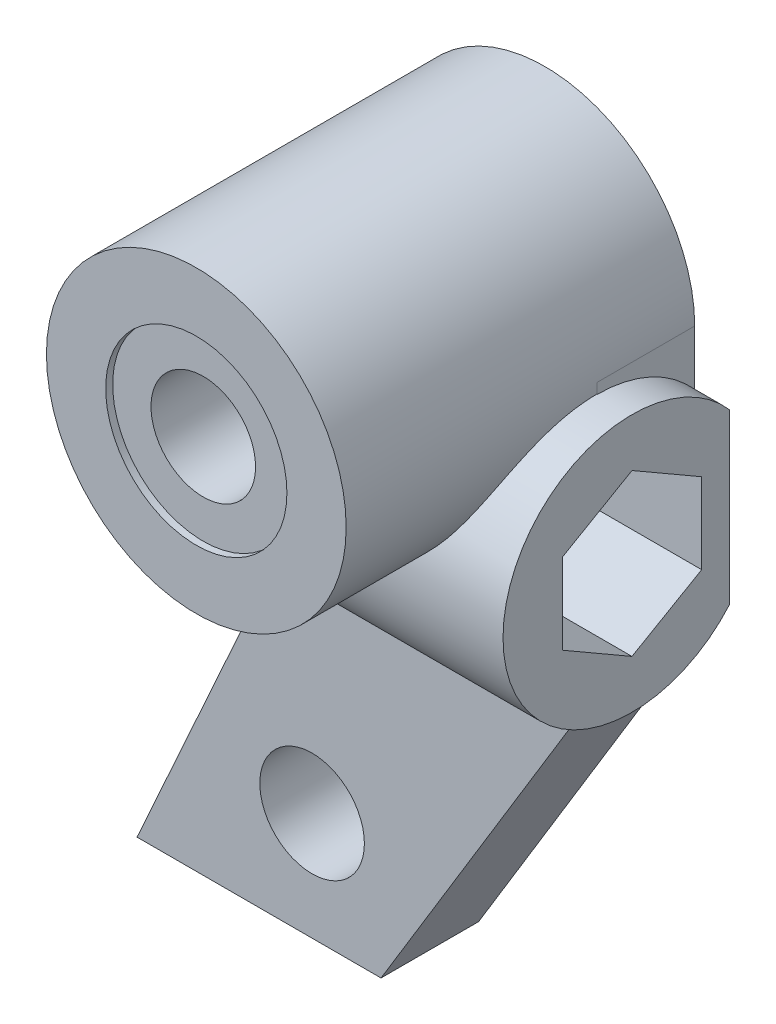
ISO-10303-21;
HEADER;
FILE_DESCRIPTION(('STEP AP214'),'2;1');
FILE_NAME('part.step','',(''),(''),'','','');
FILE_SCHEMA(('AUTOMOTIVE_DESIGN { 1 0 10303 214 1 1 1 1 }'));
ENDSEC;
DATA;
#1=APPLICATION_CONTEXT('core data for automotive mechanical design processes');
#2=APPLICATION_PROTOCOL_DEFINITION('international standard','automotive_design',2000,#1);
#3=PRODUCT_CONTEXT('',#1,'mechanical');
#4=PRODUCT('Part','Part','',(#3));
#5=PRODUCT_RELATED_PRODUCT_CATEGORY('part','',(#4));
#6=PRODUCT_DEFINITION_FORMATION('','',#4);
#7=PRODUCT_DEFINITION_CONTEXT('part definition',#1,'design');
#8=PRODUCT_DEFINITION('design','',#6,#7);
#9=PRODUCT_DEFINITION_SHAPE('','',#8);
#10=(LENGTH_UNIT() NAMED_UNIT(*) SI_UNIT(.MILLI.,.METRE.));
#11=(NAMED_UNIT(*) PLANE_ANGLE_UNIT() SI_UNIT($,.RADIAN.));
#12=(NAMED_UNIT(*) SI_UNIT($,.STERADIAN.) SOLID_ANGLE_UNIT());
#13=UNCERTAINTY_MEASURE_WITH_UNIT(LENGTH_MEASURE(1.E-05),#10,'distance_accuracy_value','');
#14=(GEOMETRIC_REPRESENTATION_CONTEXT(3) GLOBAL_UNCERTAINTY_ASSIGNED_CONTEXT((#13)) GLOBAL_UNIT_ASSIGNED_CONTEXT((#10,
#11,#12)) REPRESENTATION_CONTEXT('',''));
#15=CARTESIAN_POINT('',(0.,0.,0.));
#16=DIRECTION('',(0.,0.,1.));
#17=DIRECTION('',(1.,0.,0.));
#18=AXIS2_PLACEMENT_3D('',#15,#16,#17);
#19=CARTESIAN_POINT('',(4.3,0.,2.8));
#20=DIRECTION('',(-1.,0.,0.));
#21=DIRECTION('',(0.,0.,1.));
#22=AXIS2_PLACEMENT_3D('',#19,#20,#21);
#23=PLANE('',#22);
#24=DIRECTION('',(0.,1.,0.));
#25=VECTOR('',#24,1.);
#26=CARTESIAN_POINT('',(4.3,0.,2.8));
#27=LINE('',#26,#25);
#28=CARTESIAN_POINT('',(4.3,-0.3,2.8));
#29=VERTEX_POINT('',#28);
#30=CARTESIAN_POINT('',(4.3,0.,2.8));
#31=VERTEX_POINT('',#30);
#32=EDGE_CURVE('E307',#29,#31,#27,.T.);
#33=ORIENTED_EDGE('',*,*,#32,.F.);
#34=CARTESIAN_POINT('',(4.3,-4.,2.8));
#35=DIRECTION('',(-1.,0.,0.));
#36=DIRECTION('',(0.,0.,1.));
#37=AXIS2_PLACEMENT_3D('',#34,#35,#36);
#38=CIRCLE('',#37,3.7);
#39=CARTESIAN_POINT('',(4.3,-1.58132267551043,0.));
#40=VERTEX_POINT('',#39);
#41=EDGE_CURVE('E229',#29,#40,#38,.T.);
#42=ORIENTED_EDGE('',*,*,#41,.T.);
#43=DIRECTION('',(0.,1.,0.));
#44=VECTOR('',#43,1.);
#45=CARTESIAN_POINT('',(4.3,0.,0.));
#46=LINE('',#45,#44);
#47=CARTESIAN_POINT('',(4.3,0.,0.));
#48=VERTEX_POINT('',#47);
#49=EDGE_CURVE('E364',#40,#48,#46,.T.);
#50=ORIENTED_EDGE('',*,*,#49,.T.);
#51=DIRECTION('',(0.,0.,-1.));
#52=VECTOR('',#51,1.);
#53=CARTESIAN_POINT('',(4.3,0.,2.8));
#54=LINE('',#53,#52);
#55=EDGE_CURVE('E311',#31,#48,#54,.T.);
#56=ORIENTED_EDGE('',*,*,#55,.F.);
#57=EDGE_LOOP('',(#33,#42,#50,#56));
#58=FACE_BOUND('',#57,.T.);
#59=ADVANCED_FACE('F37',(#58),#23,.F.);
#60=CARTESIAN_POINT('',(0.,0.,2.8));
#61=DIRECTION('',(0.,0.,1.));
#62=DIRECTION('',(1.,0.,0.));
#63=AXIS2_PLACEMENT_3D('',#60,#61,#62);
#64=PLANE('',#63);
#65=DIRECTION('',(-1.,0.,0.));
#66=VECTOR('',#65,1.);
#67=CARTESIAN_POINT('',(5.3,-0.3,2.8));
#68=LINE('',#67,#66);
#69=CARTESIAN_POINT('',(4.28952211790544,-0.3,2.8));
#70=VERTEX_POINT('',#69);
#71=EDGE_CURVE('E61',#29,#70,#68,.T.);
#72=ORIENTED_EDGE('',*,*,#71,.F.);
#73=ORIENTED_EDGE('',*,*,#32,.T.);
#74=CARTESIAN_POINT('',(0.,0.,2.8));
#75=DIRECTION('',(0.,0.,1.));
#76=DIRECTION('',(1.,0.,0.));
#77=AXIS2_PLACEMENT_3D('',#74,#75,#76);
#78=CIRCLE('',#77,4.3);
#79=EDGE_CURVE('E331',#70,#31,#78,.T.);
#80=ORIENTED_EDGE('',*,*,#79,.F.);
#81=EDGE_LOOP('',(#72,#73,#80));
#82=FACE_BOUND('',#81,.T.);
#83=ADVANCED_FACE('F269',(#82),#64,.T.);
#84=CARTESIAN_POINT('',(-4.28952211790544,-0.3,2.8));
#85=VERTEX_POINT('',#84);
#86=CARTESIAN_POINT('',(-4.3,-0.3,2.8));
#87=VERTEX_POINT('',#86);
#88=EDGE_CURVE('E228',#85,#87,#68,.T.);
#89=ORIENTED_EDGE('',*,*,#88,.F.);
#90=CARTESIAN_POINT('',(-4.3,0.,2.8));
#91=VERTEX_POINT('',#90);
#92=EDGE_CURVE('E332',#91,#85,#78,.T.);
#93=ORIENTED_EDGE('',*,*,#92,.F.);
#94=DIRECTION('',(0.,-1.,0.));
#95=VECTOR('',#94,1.);
#96=CARTESIAN_POINT('',(-4.3,0.,2.8));
#97=LINE('',#96,#95);
#98=EDGE_CURVE('E336',#91,#87,#97,.T.);
#99=ORIENTED_EDGE('',*,*,#98,.T.);
#100=EDGE_LOOP('',(#89,#93,#99));
#101=FACE_BOUND('',#100,.T.);
#102=ADVANCED_FACE('F270',(#101),#64,.T.);
#103=CARTESIAN_POINT('',(0.,0.,2.8));
#104=DIRECTION('',(0.,0.,-1.));
#105=DIRECTION('',(-1.,0.,0.));
#106=AXIS2_PLACEMENT_3D('',#103,#104,#105);
#107=CYLINDRICAL_SURFACE('',#106,1.5);
#108=CARTESIAN_POINT('',(0.,0.,0.));
#109=DIRECTION('',(0.,0.,1.));
#110=DIRECTION('',(1.,0.,0.));
#111=AXIS2_PLACEMENT_3D('',#108,#109,#110);
#112=CIRCLE('',#111,1.5);
#113=CARTESIAN_POINT('',(1.5,0.,0.));
#114=VERTEX_POINT('',#113);
#115=EDGE_CURVE('E335',#114,#114,#112,.T.);
#116=ORIENTED_EDGE('',*,*,#115,.F.);
#117=EDGE_LOOP('',(#116));
#118=FACE_BOUND('',#117,.T.);
#119=CARTESIAN_POINT('',(0.,0.,9.8));
#120=DIRECTION('',(0.,0.,1.));
#121=DIRECTION('',(1.,0.,0.));
#122=AXIS2_PLACEMENT_3D('',#119,#120,#121);
#123=CIRCLE('',#122,1.5);
#124=CARTESIAN_POINT('',(1.5,0.,9.8));
#125=VERTEX_POINT('',#124);
#126=EDGE_CURVE('E238',#125,#125,#123,.T.);
#127=ORIENTED_EDGE('',*,*,#126,.T.);
#128=EDGE_LOOP('',(#127));
#129=FACE_BOUND('',#128,.T.);
#130=ADVANCED_FACE('F39',(#118,#129),#107,.F.);
#131=CARTESIAN_POINT('',(0.,0.,2.8));
#132=DIRECTION('',(0.,0.,-1.));
#133=DIRECTION('',(-1.,0.,0.));
#134=AXIS2_PLACEMENT_3D('',#131,#132,#133);
#135=CYLINDRICAL_SURFACE('',#134,4.3);
#136=ORIENTED_EDGE('',*,*,#92,.T.);
#137=CARTESIAN_POINT('',(-3.99867710573341,-1.58132267551043,0.));
#138=CARTESIAN_POINT('',(-4.02620486842408,-1.51172721531437,0.0600797642274034));
#139=CARTESIAN_POINT('',(-4.05096031246293,-1.44380215384755,0.123319114317478));
#140=CARTESIAN_POINT('',(-4.09549198022645,-1.31215776301694,0.25556570846073));
#141=CARTESIAN_POINT('',(-4.11527181700473,-1.24843540679834,0.324568718428721));
#142=CARTESIAN_POINT('',(-4.15038084887827,-1.12621952073223,0.46757387596933));
#143=CARTESIAN_POINT('',(-4.16572871648545,-1.06770479400466,0.541553381354812));
#144=CARTESIAN_POINT('',(-4.19272511903358,-0.956214545027081,0.694221609223177));
#145=CARTESIAN_POINT('',(-4.20437311186129,-0.903239835273751,0.772911019805469));
#146=CARTESIAN_POINT('',(-4.2245755965669,-0.803459809449619,0.934227477942213));
#147=CARTESIAN_POINT('',(-4.2331371179305,-0.756640630694397,1.01684508653121));
#148=CARTESIAN_POINT('',(-4.24780593926862,-0.669404551806675,1.18563845888953));
#149=CARTESIAN_POINT('',(-4.25391230559438,-0.628990090799319,1.27181556255559));
#150=CARTESIAN_POINT('',(-4.26421447689929,-0.554866369647669,1.44717988130181));
#151=CARTESIAN_POINT('',(-4.26840905110517,-0.521161436803233,1.53636899588751));
#152=CARTESIAN_POINT('',(-4.27535499572856,-0.460722422667956,1.71713450120877));
#153=CARTESIAN_POINT('',(-4.27810630150983,-0.433988653605107,1.80871099866965));
#154=CARTESIAN_POINT('',(-4.28267595360315,-0.386382623768759,1.99881603842775));
#155=CARTESIAN_POINT('',(-4.28443404126961,-0.365918056802774,2.09744832854939));
#156=CARTESIAN_POINT('',(-4.28711010408826,-0.333103376836591,2.29602277641901));
#157=CARTESIAN_POINT('',(-4.28802840939627,-0.320750075475985,2.39596440372008));
#158=CARTESIAN_POINT('',(-4.28923256896984,-0.304225226347709,2.59657308447109));
#159=CARTESIAN_POINT('',(-4.28951812672748,-0.300057514482398,2.6972404558498));
#160=CARTESIAN_POINT('',(-4.28952602519558,-0.299943685629092,2.89854498062574));
#161=CARTESIAN_POINT('',(-4.28924855595478,-0.30399479439307,2.99918213275521));
#162=CARTESIAN_POINT('',(-4.28804545082708,-0.320527119262826,3.2027579131261));
#163=CARTESIAN_POINT('',(-4.28710088472375,-0.333254156250416,3.30567656259077));
#164=CARTESIAN_POINT('',(-4.28431835395937,-0.367297222939065,3.510074165217));
#165=CARTESIAN_POINT('',(-4.28248036385706,-0.388613497225399,3.61155307729572));
#166=CARTESIAN_POINT('',(-4.2775391865435,-0.439677107571947,3.81233955961817));
#167=CARTESIAN_POINT('',(-4.27443597455657,-0.469424608729523,3.91164708730159));
#168=CARTESIAN_POINT('',(-4.26645610145018,-0.537135148987374,4.10740098565133));
#169=CARTESIAN_POINT('',(-4.2615786396868,-0.575101893948305,4.20384604332088));
#170=CARTESIAN_POINT('',(-4.24945645675381,-0.658705890366704,4.39259237670862));
#171=CARTESIAN_POINT('',(-4.24222434545982,-0.704301667287678,4.48491281025054));
#172=CARTESIAN_POINT('',(-4.22467912119803,-0.802863117938565,4.66517041104212));
#173=CARTESIAN_POINT('',(-4.21436761144423,-0.855824949064252,4.75310983142962));
#174=CARTESIAN_POINT('',(-4.18989052619798,-0.96857773597466,4.92389860676117));
#175=CARTESIAN_POINT('',(-4.17572613783667,-1.02836658496327,5.00674951992996));
#176=CARTESIAN_POINT('',(-4.14274145001494,-1.15408547454083,5.16666670436557));
#177=CARTESIAN_POINT('',(-4.1239215671232,-1.2200149653428,5.243733492386));
#178=CARTESIAN_POINT('',(-4.08221746308516,-1.35278568245551,5.3867284865849));
#179=CARTESIAN_POINT('',(-4.05966621596845,-1.41930460395928,5.45305302932312));
#180=CARTESIAN_POINT('',(-4.00923431719069,-1.55606834606735,5.57954515290042));
#181=CARTESIAN_POINT('',(-3.98135428036607,-1.62631273615171,5.63971344282029));
#182=CARTESIAN_POINT('',(-3.91983239504411,-1.76945656199671,5.75347735740265));
#183=CARTESIAN_POINT('',(-3.88619483428147,-1.84235399040845,5.80707782263946));
#184=CARTESIAN_POINT('',(-3.81284360636474,-1.98972209072873,5.90752847763453));
#185=CARTESIAN_POINT('',(-3.77313040803944,-2.06419264086489,5.95437918769893));
#186=CARTESIAN_POINT('',(-3.69170634755149,-2.2062034481644,6.03703109391816));
#187=CARTESIAN_POINT('',(-3.65057238080641,-2.2737078792185,6.073465134506));
#188=CARTESIAN_POINT('',(-3.56328426071255,-2.40820117114474,6.14093373850347));
#189=CARTESIAN_POINT('',(-3.51712853808257,-2.4751898638075,6.17196660614397));
#190=CARTESIAN_POINT('',(-3.41995785030464,-2.60780457255971,6.22884794369831));
#191=CARTESIAN_POINT('',(-3.36894366689467,-2.67343080580937,6.25469724558861));
#192=CARTESIAN_POINT('',(-3.26225797774605,-2.80262295128639,6.30157297384399));
#193=CARTESIAN_POINT('',(-3.20658466081922,-2.86618804882162,6.32259751263761));
#194=CARTESIAN_POINT('',(-3.08981018007856,-2.99174796755457,6.36059127278955));
#195=CARTESIAN_POINT('',(-3.02862758859362,-3.05369190576258,6.37747817937318));
#196=CARTESIAN_POINT('',(-2.9020816270829,-3.17420406388712,6.40720325462515));
#197=CARTESIAN_POINT('',(-2.83671677489407,-3.23277107290795,6.42003997827148));
#198=CARTESIAN_POINT('',(-2.63488856238202,-3.40267875601443,6.45329040677227));
#199=CARTESIAN_POINT('',(-2.49264230457465,-3.50827924105444,6.46845931745439));
#200=CARTESIAN_POINT('',(-2.17292429331314,-3.71621040475662,6.49080834533888));
#201=CARTESIAN_POINT('',(-1.99340222663898,-3.81552936197999,6.49639711625143));
#202=CARTESIAN_POINT('',(-1.62185000696716,-3.98767198588967,6.50098555134238));
#203=CARTESIAN_POINT('',(-1.42981183118134,-4.06047845725657,6.49998094723186));
#204=CARTESIAN_POINT('',(-1.12129123486952,-4.1528919748262,6.49698839938595));
#205=CARTESIAN_POINT('',(-1.00753756903104,-4.18194278210128,6.49560302972679));
#206=CARTESIAN_POINT('',(-0.778003591614395,-4.23065745571986,6.49288538443596));
#207=CARTESIAN_POINT('',(-0.662223108293742,-4.25032052256233,6.49155311333526));
#208=CARTESIAN_POINT('',(-0.42944211815372,-4.28011129730347,6.48941173446539));
#209=CARTESIAN_POINT('',(-0.312441609551905,-4.29023899126908,6.48860262746067));
#210=CARTESIAN_POINT('',(-0.0780015169891914,-4.30089330691847,6.48774895081323));
#211=CARTESIAN_POINT('',(0.0394380631021596,-4.30142001301745,6.48770437444849));
#212=CARTESIAN_POINT('',(0.277353938706984,-4.2927439544621,6.4884036265852));
#213=CARTESIAN_POINT('',(0.39781998192759,-4.2832597591298,6.48917026174363));
#214=CARTESIAN_POINT('',(0.637525090307753,-4.25419071401801,6.49128683720925));
#215=CARTESIAN_POINT('',(0.75676410917669,-4.23460548458226,6.49263679944099));
#216=CARTESIAN_POINT('',(0.993253791295026,-4.18545611586678,6.49543116541504));
#217=CARTESIAN_POINT('',(1.11050300044899,-4.15588498331372,6.49687563476891));
#218=CARTESIAN_POINT('',(1.34210112724462,-4.08697453222005,6.49913810616644));
#219=CARTESIAN_POINT('',(1.45645007541036,-4.04763531653161,6.499956114806));
#220=CARTESIAN_POINT('',(1.68171326823391,-3.95935730963825,6.50004058184519));
#221=CARTESIAN_POINT('',(1.79261829034839,-3.91039495064883,6.4993031869078));
#222=CARTESIAN_POINT('',(2.00987597919808,-3.80329659943176,6.49515605439509));
#223=CARTESIAN_POINT('',(2.11622829438139,-3.74515990039652,6.49174611084148));
#224=CARTESIAN_POINT('',(2.32338725338781,-3.62028739150929,6.48099712818195));
#225=CARTESIAN_POINT('',(2.42420042312524,-3.55356202437773,6.47366282695473));
#226=CARTESIAN_POINT('',(2.61950617372728,-3.41214136958035,6.45369894504286));
#227=CARTESIAN_POINT('',(2.71400070553382,-3.33744856059923,6.44107100765616));
#228=CARTESIAN_POINT('',(2.87464102918713,-3.19920607823484,6.41282206435604));
#229=CARTESIAN_POINT('',(2.94227417712782,-3.13709673696406,6.39857712109813));
#230=CARTESIAN_POINT('',(3.07286455607923,-3.00929293687238,6.36550891703496));
#231=CARTESIAN_POINT('',(3.13582278927582,-2.94359925171503,6.34668664121664));
#232=CARTESIAN_POINT('',(3.25663819229899,-2.80935152193937,6.30389984359354));
#233=CARTESIAN_POINT('',(3.31449936103604,-2.7407997829608,6.27993940455784));
#234=CARTESIAN_POINT('',(3.42484810294243,-2.60159628620175,6.22637229906757));
#235=CARTESIAN_POINT('',(3.4773355859282,-2.5309444932029,6.19676553787779));
#236=CARTESIAN_POINT('',(3.5769360639019,-2.3881257103194,6.13137474877387));
#237=CARTESIAN_POINT('',(3.62402171056646,-2.31595302695325,6.09556141007466));
#238=CARTESIAN_POINT('',(3.71240330090544,-2.17145915062008,6.01763494734561));
#239=CARTESIAN_POINT('',(3.75369923813557,-2.09913795748786,5.97552181630384));
#240=CARTESIAN_POINT('',(3.83053495277255,-1.95541401993952,5.88494461209761));
#241=CARTESIAN_POINT('',(3.86607440113194,-1.88401132824059,5.83648017617159));
#242=CARTESIAN_POINT('',(3.93158341047344,-1.74318216731209,5.73332411501073));
#243=CARTESIAN_POINT('',(3.9615532020033,-1.67375561638387,5.67863274768174));
#244=CARTESIAN_POINT('',(4.01413410756269,-1.54314410861501,5.56778198385294));
#245=CARTESIAN_POINT('',(4.0371361149982,-1.48173798522129,5.51206706412203));
#246=CARTESIAN_POINT('',(4.07905542129412,-1.36210359765348,5.39585441032327));
#247=CARTESIAN_POINT('',(4.09797132906115,-1.30387642076226,5.33535505696339));
#248=CARTESIAN_POINT('',(4.13212365602601,-1.19122608934325,5.20995622007252));
#249=CARTESIAN_POINT('',(4.14736064093706,-1.13680235087101,5.14505741501974));
#250=CARTESIAN_POINT('',(4.17461449930307,-1.03223655274103,5.01124511031731));
#251=CARTESIAN_POINT('',(4.18663018490796,-0.982096077162074,4.94233014108449));
#252=CARTESIAN_POINT('',(4.21971020904693,-0.833507707707271,4.72241208825516));
#253=CARTESIAN_POINT('',(4.23603640635746,-0.7431366732461,4.56511133760108));
#254=CARTESIAN_POINT('',(4.26059474281069,-0.586246326696775,4.23845993097373));
#255=CARTESIAN_POINT('',(4.26882388299047,-0.519735857801672,4.06910483523412));
#256=CARTESIAN_POINT('',(4.27788612958669,-0.43650550100229,3.80072346642675));
#257=CARTESIAN_POINT('',(4.28038103068503,-0.410858811588673,3.70442956280307));
#258=CARTESIAN_POINT('',(4.28433112034551,-0.367412198879867,3.51007667993887));
#259=CARTESIAN_POINT('',(4.28578660367355,-0.349610051519325,3.41201820920105));
#260=CARTESIAN_POINT('',(4.287951481676,-0.321966632027068,3.21472991045771));
#261=CARTESIAN_POINT('',(4.28866048185187,-0.312129569886506,3.11549949108705));
#262=CARTESIAN_POINT('',(4.28949136475925,-0.300496659358856,2.91659861436581));
#263=CARTESIAN_POINT('',(4.28961344076349,-0.298698163904675,2.81692831269032));
#264=CARTESIAN_POINT('',(4.2892954543165,-0.303233931341822,2.61393892077959));
#265=CARTESIAN_POINT('',(4.2888336132614,-0.309883324734602,2.51062677441785));
#266=CARTESIAN_POINT('',(4.28719265053067,-0.331812493303348,2.30492465126227));
#267=CARTESIAN_POINT('',(4.28601350032004,-0.347092611813241,2.20253471131882));
#268=CARTESIAN_POINT('',(4.28266877803358,-0.386176787837992,1.99938575504898));
#269=CARTESIAN_POINT('',(4.28050298167683,-0.409982783161964,1.89862711493962));
#270=CARTESIAN_POINT('',(4.274772405595,-0.465952744020972,1.69944746459275));
#271=CARTESIAN_POINT('',(4.27120698594126,-0.498120530415831,1.60102754551405));
#272=CARTESIAN_POINT('',(4.26213376830291,-0.570568185483719,1.40726956185911));
#273=CARTESIAN_POINT('',(4.25662529302834,-0.610850880663975,1.31193258456847));
#274=CARTESIAN_POINT('',(4.24301498558363,-0.699154896842702,1.12516095041483));
#275=CARTESIAN_POINT('',(4.23491451523543,-0.747172147578174,1.0337242728791));
#276=CARTESIAN_POINT('',(4.21539135194608,-0.850429418535141,0.855575748982419));
#277=CARTESIAN_POINT('',(4.20397373047713,-0.905658342650132,0.768856928175988));
#278=CARTESIAN_POINT('',(4.17702550836106,-1.02277411986803,0.600768663396337));
#279=CARTESIAN_POINT('',(4.161496854195,-1.08465781387542,0.519396710501402));
#280=CARTESIAN_POINT('',(4.12506873916384,-1.21595796497177,0.36074899979895));
#281=CARTESIAN_POINT('',(4.10404655468221,-1.28552227761176,0.283623249845317));
#282=CARTESIAN_POINT('',(4.05603524027775,-1.42981657807,0.136380939505599));
#283=CARTESIAN_POINT('',(4.02904580375877,-1.50454683117753,0.0662647395376089));
#284=CARTESIAN_POINT('',(3.99867710573341,-1.58132267551043,0.));
#285=B_SPLINE_CURVE_WITH_KNOTS('',3,(#137,#138,#139,#140,#141,#142,#143,#144,#145,#146,#147,
#148,#149,#150,#151,#152,#153,#154,#155,#156,#157,#158,#159,#160,#161,#162,#163,#164,#165,#166,
#167,#168,#169,#170,#171,#172,#173,#174,#175,#176,#177,#178,#179,#180,#181,#182,#183,#184,#185,
#186,#187,#188,#189,#190,#191,#192,#193,#194,#195,#196,#197,#198,#199,#200,#201,#202,#203,#204,
#205,#206,#207,#208,#209,#210,#211,#212,#213,#214,#215,#216,#217,#218,#219,#220,#221,#222,#223,
#224,#225,#226,#227,#228,#229,#230,#231,#232,#233,#234,#235,#236,#237,#238,#239,#240,#241,#242,
#243,#244,#245,#246,#247,#248,#249,#250,#251,#252,#253,#254,#255,#256,#257,#258,#259,#260,#261,
#262,#263,#264,#265,#266,#267,#268,#269,#270,#271,#272,#273,#274,#275,#276,#277,#278,#279,#280,
#281,#282,#283,#284),.UNSPECIFIED.,.F.,.F.,(4,2,2,2,2,2,2,2,2,2,2,2,2,2,2,2,2,2,2,2,2,2,2,2,2,2,
2,2,2,2,2,2,2,2,2,2,2,2,2,2,2,2,2,2,2,2,2,2,2,2,2,2,2,2,2,2,2,2,2,2,2,2,2,2,2,2,2,2,2,2,2,2,2,
4),(0.,0.287774798580455,0.575340021355943,0.86167539855752,1.14805271087309,1.43377361139287,
1.71960306360104,2.00561626803886,2.29164228038057,2.59354381860472,2.89532661480756,
3.19725079769963,3.49907308358673,3.80982338070679,4.12058252731088,4.43134775951331,
4.74225340124533,5.0515207042804,5.36062727467792,5.66963871225875,5.97862250982108,
6.26803362967307,6.55741137736961,6.8465745503552,7.13571542120325,7.39652879984272,
7.65742391712727,7.91827712645763,8.17923221495238,8.44502014206605,8.7109027898979,
9.24244832906044,9.85590755314031,10.4697639454933,10.8216638424932,11.1735937034835,
11.525524078712,11.8774513596454,12.2395424541,12.6016471590593,12.9640059789337,
13.3263609835454,13.6896147360347,14.0528964879185,14.4157406359399,14.7784722299439,
15.0569687981542,15.3354054901982,15.6136217517007,15.8918426815867,16.1714152251781,
16.4509880799477,16.7305769097847,17.0101541638746,17.2680020037025,17.5259374887448,
17.7838332853824,18.0418240503717,18.5858567050303,19.1300907810541,19.4288510426919,
19.7275265459673,20.0263598130175,20.3250946682432,20.6353074646385,20.9455326023003,
21.255828294466,21.5662660240065,21.8768120697815,22.1871952233005,22.4971063182016,
22.8068709388267,23.124255708071,23.4416567882686),.UNSPECIFIED.);
#286=EDGE_CURVE('E232',#85,#70,#285,.T.);
#287=ORIENTED_EDGE('',*,*,#286,.T.);
#288=ORIENTED_EDGE('',*,*,#79,.T.);
#289=ORIENTED_EDGE('',*,*,#55,.T.);
#290=CARTESIAN_POINT('',(0.,0.,0.));
#291=DIRECTION('',(0.,0.,1.));
#292=DIRECTION('',(1.,0.,0.));
#293=AXIS2_PLACEMENT_3D('',#290,#291,#292);
#294=CIRCLE('',#293,4.3);
#295=CARTESIAN_POINT('',(-4.3,0.,0.));
#296=VERTEX_POINT('',#295);
#297=EDGE_CURVE('E350',#48,#296,#294,.T.);
#298=ORIENTED_EDGE('',*,*,#297,.T.);
#299=DIRECTION('',(0.,0.,-1.));
#300=VECTOR('',#299,1.);
#301=CARTESIAN_POINT('',(-4.3,0.,2.8));
#302=LINE('',#301,#300);
#303=EDGE_CURVE('E11',#91,#296,#302,.T.);
#304=ORIENTED_EDGE('',*,*,#303,.F.);
#305=EDGE_LOOP('',(#136,#287,#288,#289,#298,#304));
#306=FACE_BOUND('',#305,.T.);
#307=CARTESIAN_POINT('',(0.,0.,10.));
#308=DIRECTION('',(0.,0.,-1.));
#309=DIRECTION('',(-1.,0.,0.));
#310=AXIS2_PLACEMENT_3D('',#307,#308,#309);
#311=CIRCLE('',#310,4.3);
#312=CARTESIAN_POINT('',(-4.3,0.,10.));
#313=VERTEX_POINT('',#312);
#314=EDGE_CURVE('E327',#313,#313,#311,.T.);
#315=ORIENTED_EDGE('',*,*,#314,.T.);
#316=EDGE_LOOP('',(#315));
#317=FACE_BOUND('',#316,.T.);
#318=ADVANCED_FACE('F240',(#306,#317),#135,.T.);
#319=CARTESIAN_POINT('',(-4.3,0.,2.8));
#320=DIRECTION('',(1.,0.,0.));
#321=DIRECTION('',(0.,0.,-1.));
#322=AXIS2_PLACEMENT_3D('',#319,#320,#321);
#323=PLANE('',#322);
#324=CARTESIAN_POINT('',(-4.3,-4.,2.8));
#325=DIRECTION('',(-1.,0.,0.));
#326=DIRECTION('',(0.,0.,1.));
#327=AXIS2_PLACEMENT_3D('',#324,#325,#326);
#328=CIRCLE('',#327,1.5);
#329=CARTESIAN_POINT('',(-4.3,-4.,4.3));
#330=VERTEX_POINT('',#329);
#331=EDGE_CURVE('E179',#330,#330,#328,.T.);
#332=ORIENTED_EDGE('',*,*,#331,.F.);
#333=EDGE_LOOP('',(#332));
#334=FACE_BOUND('',#333,.T.);
#335=DIRECTION('',(0.,0.,-1.));
#336=VECTOR('',#335,1.);
#337=CARTESIAN_POINT('',(-4.3,-7.7,2.8));
#338=LINE('',#337,#336);
#339=CARTESIAN_POINT('',(-4.3,-7.7,2.8));
#340=VERTEX_POINT('',#339);
#341=CARTESIAN_POINT('',(-4.3,-7.7,0.));
#342=VERTEX_POINT('',#341);
#343=EDGE_CURVE('E46',#340,#342,#338,.T.);
#344=ORIENTED_EDGE('',*,*,#343,.F.);
#345=CARTESIAN_POINT('',(-4.3,-4.,2.8));
#346=DIRECTION('',(-1.,0.,0.));
#347=DIRECTION('',(0.,0.,1.));
#348=AXIS2_PLACEMENT_3D('',#345,#346,#347);
#349=CIRCLE('',#348,3.7);
#350=EDGE_CURVE('E201',#340,#87,#349,.T.);
#351=ORIENTED_EDGE('',*,*,#350,.T.);
#352=ORIENTED_EDGE('',*,*,#98,.F.);
#353=ORIENTED_EDGE('',*,*,#303,.T.);
#354=DIRECTION('',(0.,-1.,0.));
#355=VECTOR('',#354,1.);
#356=CARTESIAN_POINT('',(-4.3,0.,0.));
#357=LINE('',#356,#355);
#358=EDGE_CURVE('E353',#296,#342,#357,.T.);
#359=ORIENTED_EDGE('',*,*,#358,.T.);
#360=EDGE_LOOP('',(#344,#351,#352,#353,#359));
#361=FACE_BOUND('',#360,.T.);
#362=ADVANCED_FACE('F291',(#334,#361),#323,.F.);
#363=CARTESIAN_POINT('',(-0.687603833865818,0.310095846645369,2.8));
#364=DIRECTION('',(-0.911586756889032,0.411107753106818,0.));
#365=DIRECTION('',(-0.411107753106818,-0.911586756889032,0.));
#366=AXIS2_PLACEMENT_3D('',#363,#364,#365);
#367=PLANE('',#366);
#368=DIRECTION('',(0.411107753106818,0.911586756889032,0.));
#369=VECTOR('',#368,1.);
#370=CARTESIAN_POINT('',(-0.687603833865818,0.310095846645369,0.));
#371=LINE('',#370,#369);
#372=CARTESIAN_POINT('',(-8.9,-17.9,0.));
#373=VERTEX_POINT('',#372);
#374=EDGE_CURVE('E355',#373,#342,#371,.T.);
#375=ORIENTED_EDGE('',*,*,#374,.F.);
#376=DIRECTION('',(0.,0.,-1.));
#377=VECTOR('',#376,1.);
#378=CARTESIAN_POINT('',(-8.9,-17.9,2.8));
#379=LINE('',#378,#377);
#380=CARTESIAN_POINT('',(-8.9,-17.9,2.8));
#381=VERTEX_POINT('',#380);
#382=EDGE_CURVE('E374',#381,#373,#379,.T.);
#383=ORIENTED_EDGE('',*,*,#382,.F.);
#384=DIRECTION('',(0.411107753106818,0.911586756889032,0.));
#385=VECTOR('',#384,1.);
#386=CARTESIAN_POINT('',(-0.687603833865818,0.310095846645369,2.8));
#387=LINE('',#386,#385);
#388=EDGE_CURVE('E338',#381,#340,#387,.T.);
#389=ORIENTED_EDGE('',*,*,#388,.T.);
#390=ORIENTED_EDGE('',*,*,#343,.T.);
#391=EDGE_LOOP('',(#375,#383,#389,#390));
#392=FACE_BOUND('',#391,.T.);
#393=ADVANCED_FACE('F288',(#392),#367,.T.);
#394=CARTESIAN_POINT('',(0.,-17.9,2.8));
#395=DIRECTION('',(0.,-1.,0.));
#396=DIRECTION('',(1.,0.,0.));
#397=AXIS2_PLACEMENT_3D('',#394,#395,#396);
#398=PLANE('',#397);
#399=DIRECTION('',(-1.,0.,0.));
#400=VECTOR('',#399,1.);
#401=CARTESIAN_POINT('',(0.,-17.9,0.));
#402=LINE('',#401,#400);
#403=CARTESIAN_POINT('',(-1.9,-17.9,0.));
#404=VERTEX_POINT('',#403);
#405=EDGE_CURVE('E358',#404,#373,#402,.T.);
#406=ORIENTED_EDGE('',*,*,#405,.F.);
#407=DIRECTION('',(0.,0.,-1.));
#408=VECTOR('',#407,1.);
#409=CARTESIAN_POINT('',(-1.9,-17.9,2.8));
#410=LINE('',#409,#408);
#411=CARTESIAN_POINT('',(-1.9,-17.9,2.8));
#412=VERTEX_POINT('',#411);
#413=EDGE_CURVE('E372',#412,#404,#410,.T.);
#414=ORIENTED_EDGE('',*,*,#413,.F.);
#415=DIRECTION('',(-1.,0.,0.));
#416=VECTOR('',#415,1.);
#417=CARTESIAN_POINT('',(0.,-17.9,2.8));
#418=LINE('',#417,#416);
#419=EDGE_CURVE('E341',#412,#381,#418,.T.);
#420=ORIENTED_EDGE('',*,*,#419,.T.);
#421=ORIENTED_EDGE('',*,*,#382,.T.);
#422=EDGE_LOOP('',(#406,#414,#420,#421));
#423=FACE_BOUND('',#422,.T.);
#424=ADVANCED_FACE('F284',(#423),#398,.T.);
#425=CARTESIAN_POINT('',(6.55755193711398,-3.98596294216732,2.8));
#426=DIRECTION('',(0.854521941471326,-0.51941529775708,0.));
#427=DIRECTION('',(0.51941529775708,0.854521941471326,0.));
#428=AXIS2_PLACEMENT_3D('',#425,#426,#427);
#429=PLANE('',#428);
#430=DIRECTION('',(-0.51941529775708,-0.854521941471326,0.));
#431=VECTOR('',#430,1.);
#432=CARTESIAN_POINT('',(6.55755193711398,-3.98596294216732,0.));
#433=LINE('',#432,#431);
#434=CARTESIAN_POINT('',(4.3,-7.7,0.));
#435=VERTEX_POINT('',#434);
#436=EDGE_CURVE('E361',#435,#404,#433,.T.);
#437=ORIENTED_EDGE('',*,*,#436,.F.);
#438=DIRECTION('',(0.,0.,-1.));
#439=VECTOR('',#438,1.);
#440=CARTESIAN_POINT('',(4.3,-7.7,2.8));
#441=LINE('',#440,#439);
#442=CARTESIAN_POINT('',(4.3,-7.7,2.8));
#443=VERTEX_POINT('',#442);
#444=EDGE_CURVE('E370',#443,#435,#441,.T.);
#445=ORIENTED_EDGE('',*,*,#444,.F.);
#446=DIRECTION('',(-0.51941529775708,-0.854521941471326,0.));
#447=VECTOR('',#446,1.);
#448=CARTESIAN_POINT('',(6.55755193711398,-3.98596294216732,2.8));
#449=LINE('',#448,#447);
#450=EDGE_CURVE('E314',#443,#412,#449,.T.);
#451=ORIENTED_EDGE('',*,*,#450,.T.);
#452=ORIENTED_EDGE('',*,*,#413,.T.);
#453=EDGE_LOOP('',(#437,#445,#451,#452));
#454=FACE_BOUND('',#453,.T.);
#455=ADVANCED_FACE('F280',(#454),#429,.T.);
#456=CARTESIAN_POINT('',(4.3,-6.41867732448957,0.));
#457=VERTEX_POINT('',#456);
#458=EDGE_CURVE('E365',#435,#457,#46,.T.);
#459=ORIENTED_EDGE('',*,*,#458,.T.);
#460=EDGE_CURVE('E226',#457,#443,#38,.T.);
#461=ORIENTED_EDGE('',*,*,#460,.T.);
#462=ORIENTED_EDGE('',*,*,#444,.T.);
#463=EDGE_LOOP('',(#459,#461,#462));
#464=FACE_BOUND('',#463,.T.);
#465=ADVANCED_FACE('F276',(#464),#23,.F.);
#466=CARTESIAN_POINT('',(-3.87749466098379,-14.8,2.8));
#467=DIRECTION('',(0.,0.,-1.));
#468=DIRECTION('',(-1.,0.,0.));
#469=AXIS2_PLACEMENT_3D('',#466,#467,#468);
#470=CYLINDRICAL_SURFACE('',#469,1.5);
#471=CARTESIAN_POINT('',(-3.87749466098379,-14.8,2.8));
#472=DIRECTION('',(0.,0.,1.));
#473=DIRECTION('',(1.,0.,0.));
#474=AXIS2_PLACEMENT_3D('',#471,#472,#473);
#475=CIRCLE('',#474,1.5);
#476=CARTESIAN_POINT('',(-2.37749466098379,-14.8,2.8));
#477=VERTEX_POINT('',#476);
#478=EDGE_CURVE('E313',#477,#477,#475,.T.);
#479=ORIENTED_EDGE('',*,*,#478,.T.);
#480=EDGE_LOOP('',(#479));
#481=FACE_BOUND('',#480,.T.);
#482=CARTESIAN_POINT('',(-3.87749466098379,-14.8,0.));
#483=DIRECTION('',(0.,0.,1.));
#484=DIRECTION('',(1.,0.,0.));
#485=AXIS2_PLACEMENT_3D('',#482,#483,#484);
#486=CIRCLE('',#485,1.5);
#487=CARTESIAN_POINT('',(-2.37749466098379,-14.8,0.));
#488=VERTEX_POINT('',#487);
#489=EDGE_CURVE('E339',#488,#488,#486,.T.);
#490=ORIENTED_EDGE('',*,*,#489,.F.);
#491=EDGE_LOOP('',(#490));
#492=FACE_BOUND('',#491,.T.);
#493=ADVANCED_FACE('F267',(#481,#492),#470,.F.);
#494=DIRECTION('',(-1.,0.,0.));
#495=VECTOR('',#494,1.);
#496=CARTESIAN_POINT('',(5.3,-7.7,2.8));
#497=LINE('',#496,#495);
#498=EDGE_CURVE('E221',#340,#443,#497,.F.);
#499=ORIENTED_EDGE('',*,*,#498,.F.);
#500=ORIENTED_EDGE('',*,*,#388,.F.);
#501=ORIENTED_EDGE('',*,*,#419,.F.);
#502=ORIENTED_EDGE('',*,*,#450,.F.);
#503=EDGE_LOOP('',(#499,#500,#501,#502));
#504=FACE_BOUND('',#503,.T.);
#505=ORIENTED_EDGE('',*,*,#478,.F.);
#506=EDGE_LOOP('',(#505));
#507=FACE_BOUND('',#506,.T.);
#508=ADVANCED_FACE('F264',(#504,#507),#64,.T.);
#509=CARTESIAN_POINT('',(0.,0.,0.));
#510=DIRECTION('',(0.,0.,1.));
#511=DIRECTION('',(1.,0.,0.));
#512=AXIS2_PLACEMENT_3D('',#509,#510,#511);
#513=PLANE('',#512);
#514=ORIENTED_EDGE('',*,*,#374,.T.);
#515=ORIENTED_EDGE('',*,*,#358,.F.);
#516=ORIENTED_EDGE('',*,*,#297,.F.);
#517=ORIENTED_EDGE('',*,*,#49,.F.);
#518=DIRECTION('',(-1.,0.,0.));
#519=VECTOR('',#518,1.);
#520=CARTESIAN_POINT('',(5.3,-1.58132267551043,0.));
#521=LINE('',#520,#519);
#522=CARTESIAN_POINT('',(5.3,-1.58132267551043,0.));
#523=VERTEX_POINT('',#522);
#524=EDGE_CURVE('E215',#523,#40,#521,.T.);
#525=ORIENTED_EDGE('',*,*,#524,.F.);
#526=DIRECTION('',(0.,-1.,0.));
#527=VECTOR('',#526,1.);
#528=CARTESIAN_POINT('',(5.3,-1.58132267551043,0.));
#529=LINE('',#528,#527);
#530=CARTESIAN_POINT('',(5.3,-6.41867732448957,0.));
#531=VERTEX_POINT('',#530);
#532=EDGE_CURVE('E212',#523,#531,#529,.T.);
#533=ORIENTED_EDGE('',*,*,#532,.T.);
#534=DIRECTION('',(-1.,0.,0.));
#535=VECTOR('',#534,1.);
#536=CARTESIAN_POINT('',(5.3,-6.41867732448957,0.));
#537=LINE('',#536,#535);
#538=EDGE_CURVE('E218',#531,#457,#537,.T.);
#539=ORIENTED_EDGE('',*,*,#538,.T.);
#540=ORIENTED_EDGE('',*,*,#458,.F.);
#541=ORIENTED_EDGE('',*,*,#436,.T.);
#542=ORIENTED_EDGE('',*,*,#405,.T.);
#543=EDGE_LOOP('',(#514,#515,#516,#517,#525,#533,#539,#540,#541,#542));
#544=FACE_BOUND('',#543,.T.);
#545=ORIENTED_EDGE('',*,*,#489,.T.);
#546=EDGE_LOOP('',(#545));
#547=FACE_BOUND('',#546,.T.);
#548=ORIENTED_EDGE('',*,*,#115,.T.);
#549=EDGE_LOOP('',(#548));
#550=FACE_BOUND('',#549,.T.);
#551=ADVANCED_FACE('F262',(#544,#547,#550),#513,.F.);
#552=CARTESIAN_POINT('',(0.,0.,10.));
#553=DIRECTION('',(0.,0.,-1.));
#554=DIRECTION('',(-1.,0.,0.));
#555=AXIS2_PLACEMENT_3D('',#552,#553,#554);
#556=PLANE('',#555);
#557=CARTESIAN_POINT('',(0.,0.,10.));
#558=DIRECTION('',(0.,0.,1.));
#559=DIRECTION('',(1.,0.,0.));
#560=AXIS2_PLACEMENT_3D('',#557,#558,#559);
#561=CIRCLE('',#560,2.6);
#562=CARTESIAN_POINT('',(2.6,0.,10.));
#563=VERTEX_POINT('',#562);
#564=EDGE_CURVE('E318',#563,#563,#561,.T.);
#565=ORIENTED_EDGE('',*,*,#564,.F.);
#566=EDGE_LOOP('',(#565));
#567=FACE_BOUND('',#566,.T.);
#568=ORIENTED_EDGE('',*,*,#314,.F.);
#569=EDGE_LOOP('',(#568));
#570=FACE_BOUND('',#569,.T.);
#571=ADVANCED_FACE('F258',(#567,#570),#556,.F.);
#572=CARTESIAN_POINT('',(0.,0.,9.8));
#573=DIRECTION('',(0.,0.,1.));
#574=DIRECTION('',(1.,0.,0.));
#575=AXIS2_PLACEMENT_3D('',#572,#573,#574);
#576=CYLINDRICAL_SURFACE('',#575,2.6);
#577=CARTESIAN_POINT('',(0.,0.,9.8));
#578=DIRECTION('',(0.,0.,1.));
#579=DIRECTION('',(1.,0.,0.));
#580=AXIS2_PLACEMENT_3D('',#577,#578,#579);
#581=CIRCLE('',#580,2.6);
#582=CARTESIAN_POINT('',(2.6,0.,9.8));
#583=VERTEX_POINT('',#582);
#584=EDGE_CURVE('E322',#583,#583,#581,.T.);
#585=ORIENTED_EDGE('',*,*,#584,.F.);
#586=EDGE_LOOP('',(#585));
#587=FACE_BOUND('',#586,.T.);
#588=ORIENTED_EDGE('',*,*,#564,.T.);
#589=EDGE_LOOP('',(#588));
#590=FACE_BOUND('',#589,.T.);
#591=ADVANCED_FACE('F254',(#587,#590),#576,.F.);
#592=CARTESIAN_POINT('',(0.,0.,9.8));
#593=DIRECTION('',(0.,0.,1.));
#594=DIRECTION('',(1.,0.,0.));
#595=AXIS2_PLACEMENT_3D('',#592,#593,#594);
#596=PLANE('',#595);
#597=ORIENTED_EDGE('',*,*,#126,.F.);
#598=EDGE_LOOP('',(#597));
#599=FACE_BOUND('',#598,.T.);
#600=ORIENTED_EDGE('',*,*,#584,.T.);
#601=EDGE_LOOP('',(#600));
#602=FACE_BOUND('',#601,.T.);
#603=ADVANCED_FACE('F251',(#599,#602),#596,.T.);
#604=CARTESIAN_POINT('',(5.3,-4.,2.8));
#605=DIRECTION('',(-1.,0.,0.));
#606=DIRECTION('',(0.,0.,1.));
#607=AXIS2_PLACEMENT_3D('',#604,#605,#606);
#608=PLANE('',#607);
#609=DIRECTION('',(0.,1.,0.));
#610=VECTOR('',#609,1.);
#611=CARTESIAN_POINT('',(5.3,-5.15470053837926,0.799999999999999));
#612=LINE('',#611,#610);
#613=CARTESIAN_POINT('',(5.3,-5.15470053837926,0.799999999999999));
#614=VERTEX_POINT('',#613);
#615=CARTESIAN_POINT('',(5.3,-2.84529946162075,0.799999999999999));
#616=VERTEX_POINT('',#615);
#617=EDGE_CURVE('E189',#614,#616,#612,.T.);
#618=ORIENTED_EDGE('',*,*,#617,.F.);
#619=DIRECTION('',(0.,0.5,-0.866025403784439));
#620=VECTOR('',#619,1.);
#621=CARTESIAN_POINT('',(5.3,-6.30940107675851,2.8));
#622=LINE('',#621,#620);
#623=CARTESIAN_POINT('',(5.3,-6.30940107675851,2.8));
#624=VERTEX_POINT('',#623);
#625=EDGE_CURVE('E53',#624,#614,#622,.T.);
#626=ORIENTED_EDGE('',*,*,#625,.F.);
#627=DIRECTION('',(0.,-0.5,-0.866025403784438));
#628=VECTOR('',#627,1.);
#629=CARTESIAN_POINT('',(5.3,-5.15470053837925,4.8));
#630=LINE('',#629,#628);
#631=CARTESIAN_POINT('',(5.3,-5.15470053837925,4.8));
#632=VERTEX_POINT('',#631);
#633=EDGE_CURVE('E173',#632,#624,#630,.T.);
#634=ORIENTED_EDGE('',*,*,#633,.F.);
#635=DIRECTION('',(0.,-1.,0.));
#636=VECTOR('',#635,1.);
#637=CARTESIAN_POINT('',(5.3,-2.84529946162075,4.8));
#638=LINE('',#637,#636);
#639=CARTESIAN_POINT('',(5.3,-2.84529946162075,4.8));
#640=VERTEX_POINT('',#639);
#641=EDGE_CURVE('E176',#640,#632,#638,.T.);
#642=ORIENTED_EDGE('',*,*,#641,.F.);
#643=DIRECTION('',(0.,-0.5,0.866025403784439));
#644=VECTOR('',#643,1.);
#645=CARTESIAN_POINT('',(5.3,-1.6905989232415,2.8));
#646=LINE('',#645,#644);
#647=CARTESIAN_POINT('',(5.3,-1.6905989232415,2.8));
#648=VERTEX_POINT('',#647);
#649=EDGE_CURVE('E194',#648,#640,#646,.T.);
#650=ORIENTED_EDGE('',*,*,#649,.F.);
#651=DIRECTION('',(0.,0.5,0.866025403784438));
#652=VECTOR('',#651,1.);
#653=CARTESIAN_POINT('',(5.3,-2.84529946162075,0.799999999999999));
#654=LINE('',#653,#652);
#655=EDGE_CURVE('E191',#616,#648,#654,.T.);
#656=ORIENTED_EDGE('',*,*,#655,.F.);
#657=EDGE_LOOP('',(#618,#626,#634,#642,#650,#656));
#658=FACE_BOUND('',#657,.T.);
#659=CARTESIAN_POINT('',(5.3,-4.,2.8));
#660=DIRECTION('',(-1.,0.,0.));
#661=DIRECTION('',(0.,0.,1.));
#662=AXIS2_PLACEMENT_3D('',#659,#660,#661);
#663=CIRCLE('',#662,3.7);
#664=EDGE_CURVE('E209',#531,#523,#663,.T.);
#665=ORIENTED_EDGE('',*,*,#664,.F.);
#666=ORIENTED_EDGE('',*,*,#532,.F.);
#667=EDGE_LOOP('',(#665,#666));
#668=FACE_BOUND('',#667,.T.);
#669=ADVANCED_FACE('F248',(#658,#668),#608,.F.);
#670=CARTESIAN_POINT('',(5.3,-4.,2.8));
#671=DIRECTION('',(-1.,0.,0.));
#672=DIRECTION('',(0.,0.,1.));
#673=AXIS2_PLACEMENT_3D('',#670,#671,#672);
#674=CYLINDRICAL_SURFACE('',#673,3.7);
#675=ORIENTED_EDGE('',*,*,#41,.F.);
#676=ORIENTED_EDGE('',*,*,#71,.T.);
#677=ORIENTED_EDGE('',*,*,#286,.F.);
#678=ORIENTED_EDGE('',*,*,#88,.T.);
#679=ORIENTED_EDGE('',*,*,#350,.F.);
#680=ORIENTED_EDGE('',*,*,#498,.T.);
#681=ORIENTED_EDGE('',*,*,#460,.F.);
#682=ORIENTED_EDGE('',*,*,#538,.F.);
#683=ORIENTED_EDGE('',*,*,#664,.T.);
#684=ORIENTED_EDGE('',*,*,#524,.T.);
#685=EDGE_LOOP('',(#675,#676,#677,#678,#679,#680,#681,#682,#683,#684));
#686=FACE_BOUND('',#685,.T.);
#687=ADVANCED_FACE('F243',(#686),#674,.T.);
#688=CARTESIAN_POINT('',(-1.7,-6.30940107675851,2.8));
#689=DIRECTION('',(0.,-0.866025403784439,-0.5));
#690=DIRECTION('',(0.,0.5,-0.866025403784439));
#691=AXIS2_PLACEMENT_3D('',#688,#689,#690);
#692=PLANE('',#691);
#693=ORIENTED_EDGE('',*,*,#625,.T.);
#694=DIRECTION('',(1.,0.,0.));
#695=VECTOR('',#694,1.);
#696=CARTESIAN_POINT('',(-1.7,-5.15470053837926,0.799999999999999));
#697=LINE('',#696,#695);
#698=CARTESIAN_POINT('',(-1.7,-5.15470053837926,0.799999999999999));
#699=VERTEX_POINT('',#698);
#700=EDGE_CURVE('E150',#699,#614,#697,.T.);
#701=ORIENTED_EDGE('',*,*,#700,.F.);
#702=DIRECTION('',(0.,0.5,-0.866025403784439));
#703=VECTOR('',#702,1.);
#704=CARTESIAN_POINT('',(-1.7,-6.30940107675851,2.8));
#705=LINE('',#704,#703);
#706=CARTESIAN_POINT('',(-1.7,-6.30940107675851,2.8));
#707=VERTEX_POINT('',#706);
#708=EDGE_CURVE('E154',#707,#699,#705,.T.);
#709=ORIENTED_EDGE('',*,*,#708,.F.);
#710=DIRECTION('',(1.,0.,0.));
#711=VECTOR('',#710,1.);
#712=CARTESIAN_POINT('',(-1.7,-6.30940107675851,2.8));
#713=LINE('',#712,#711);
#714=EDGE_CURVE('E199',#707,#624,#713,.T.);
#715=ORIENTED_EDGE('',*,*,#714,.T.);
#716=EDGE_LOOP('',(#693,#701,#709,#715));
#717=FACE_BOUND('',#716,.T.);
#718=ADVANCED_FACE('F152',(#717),#692,.F.);
#719=CARTESIAN_POINT('',(-1.7,-5.15470053837925,4.8));
#720=DIRECTION('',(0.,-0.866025403784438,0.5));
#721=DIRECTION('',(0.,-0.5,-0.866025403784438));
#722=AXIS2_PLACEMENT_3D('',#719,#720,#721);
#723=PLANE('',#722);
#724=ORIENTED_EDGE('',*,*,#633,.T.);
#725=ORIENTED_EDGE('',*,*,#714,.F.);
#726=DIRECTION('',(0.,-0.5,-0.866025403784438));
#727=VECTOR('',#726,1.);
#728=CARTESIAN_POINT('',(-1.7,-5.15470053837925,4.8));
#729=LINE('',#728,#727);
#730=CARTESIAN_POINT('',(-1.7,-5.15470053837925,4.8));
#731=VERTEX_POINT('',#730);
#732=EDGE_CURVE('E160',#731,#707,#729,.T.);
#733=ORIENTED_EDGE('',*,*,#732,.F.);
#734=DIRECTION('',(1.,0.,0.));
#735=VECTOR('',#734,1.);
#736=CARTESIAN_POINT('',(-1.7,-5.15470053837925,4.8));
#737=LINE('',#736,#735);
#738=EDGE_CURVE('E202',#731,#632,#737,.T.);
#739=ORIENTED_EDGE('',*,*,#738,.T.);
#740=EDGE_LOOP('',(#724,#725,#733,#739));
#741=FACE_BOUND('',#740,.T.);
#742=ADVANCED_FACE('F415',(#741),#723,.F.);
#743=CARTESIAN_POINT('',(-1.7,-2.84529946162075,4.8));
#744=DIRECTION('',(0.,0.,1.));
#745=DIRECTION('',(0.,-1.,0.));
#746=AXIS2_PLACEMENT_3D('',#743,#744,#745);
#747=PLANE('',#746);
#748=ORIENTED_EDGE('',*,*,#641,.T.);
#749=ORIENTED_EDGE('',*,*,#738,.F.);
#750=DIRECTION('',(0.,-1.,0.));
#751=VECTOR('',#750,1.);
#752=CARTESIAN_POINT('',(-1.7,-2.84529946162075,4.8));
#753=LINE('',#752,#751);
#754=CARTESIAN_POINT('',(-1.7,-2.84529946162075,4.8));
#755=VERTEX_POINT('',#754);
#756=EDGE_CURVE('E185',#755,#731,#753,.T.);
#757=ORIENTED_EDGE('',*,*,#756,.F.);
#758=DIRECTION('',(1.,0.,0.));
#759=VECTOR('',#758,1.);
#760=CARTESIAN_POINT('',(-1.7,-2.84529946162075,4.8));
#761=LINE('',#760,#759);
#762=EDGE_CURVE('E204',#755,#640,#761,.T.);
#763=ORIENTED_EDGE('',*,*,#762,.T.);
#764=EDGE_LOOP('',(#748,#749,#757,#763));
#765=FACE_BOUND('',#764,.T.);
#766=ADVANCED_FACE('F413',(#765),#747,.F.);
#767=CARTESIAN_POINT('',(-1.7,-1.6905989232415,2.8));
#768=DIRECTION('',(0.,0.866025403784439,0.5));
#769=DIRECTION('',(0.,-0.5,0.866025403784439));
#770=AXIS2_PLACEMENT_3D('',#767,#768,#769);
#771=PLANE('',#770);
#772=ORIENTED_EDGE('',*,*,#649,.T.);
#773=ORIENTED_EDGE('',*,*,#762,.F.);
#774=DIRECTION('',(0.,-0.5,0.866025403784439));
#775=VECTOR('',#774,1.);
#776=CARTESIAN_POINT('',(-1.7,-1.6905989232415,2.8));
#777=LINE('',#776,#775);
#778=CARTESIAN_POINT('',(-1.7,-1.6905989232415,2.8));
#779=VERTEX_POINT('',#778);
#780=EDGE_CURVE('E182',#779,#755,#777,.T.);
#781=ORIENTED_EDGE('',*,*,#780,.F.);
#782=DIRECTION('',(1.,0.,0.));
#783=VECTOR('',#782,1.);
#784=CARTESIAN_POINT('',(-1.7,-1.6905989232415,2.8));
#785=LINE('',#784,#783);
#786=EDGE_CURVE('E206',#779,#648,#785,.T.);
#787=ORIENTED_EDGE('',*,*,#786,.T.);
#788=EDGE_LOOP('',(#772,#773,#781,#787));
#789=FACE_BOUND('',#788,.T.);
#790=ADVANCED_FACE('F411',(#789),#771,.F.);
#791=CARTESIAN_POINT('',(-1.7,-2.84529946162075,0.799999999999999));
#792=DIRECTION('',(0.,0.866025403784438,-0.5));
#793=DIRECTION('',(0.,0.5,0.866025403784439));
#794=AXIS2_PLACEMENT_3D('',#791,#792,#793);
#795=PLANE('',#794);
#796=ORIENTED_EDGE('',*,*,#655,.T.);
#797=ORIENTED_EDGE('',*,*,#786,.F.);
#798=DIRECTION('',(0.,0.5,0.866025403784438));
#799=VECTOR('',#798,1.);
#800=CARTESIAN_POINT('',(-1.7,-2.84529946162075,0.799999999999999));
#801=LINE('',#800,#799);
#802=CARTESIAN_POINT('',(-1.7,-2.84529946162075,0.799999999999999));
#803=VERTEX_POINT('',#802);
#804=EDGE_CURVE('E168',#803,#779,#801,.T.);
#805=ORIENTED_EDGE('',*,*,#804,.F.);
#806=DIRECTION('',(1.,0.,0.));
#807=VECTOR('',#806,1.);
#808=CARTESIAN_POINT('',(-1.7,-2.84529946162075,0.799999999999999));
#809=LINE('',#808,#807);
#810=EDGE_CURVE('E159',#803,#616,#809,.T.);
#811=ORIENTED_EDGE('',*,*,#810,.T.);
#812=EDGE_LOOP('',(#796,#797,#805,#811));
#813=FACE_BOUND('',#812,.T.);
#814=ADVANCED_FACE('F407',(#813),#795,.F.);
#815=CARTESIAN_POINT('',(-1.7,-5.15470053837926,0.799999999999999));
#816=DIRECTION('',(0.,0.,-1.));
#817=DIRECTION('',(0.,1.,0.));
#818=AXIS2_PLACEMENT_3D('',#815,#816,#817);
#819=PLANE('',#818);
#820=ORIENTED_EDGE('',*,*,#617,.T.);
#821=ORIENTED_EDGE('',*,*,#810,.F.);
#822=DIRECTION('',(0.,1.,0.));
#823=VECTOR('',#822,1.);
#824=CARTESIAN_POINT('',(-1.7,-5.15470053837926,0.799999999999999));
#825=LINE('',#824,#823);
#826=EDGE_CURVE('E163',#699,#803,#825,.T.);
#827=ORIENTED_EDGE('',*,*,#826,.F.);
#828=ORIENTED_EDGE('',*,*,#700,.T.);
#829=EDGE_LOOP('',(#820,#821,#827,#828));
#830=FACE_BOUND('',#829,.T.);
#831=ADVANCED_FACE('F164',(#830),#819,.F.);
#832=CARTESIAN_POINT('',(-1.7,0.,0.));
#833=DIRECTION('',(1.,0.,0.));
#834=DIRECTION('',(0.,0.,-1.));
#835=AXIS2_PLACEMENT_3D('',#832,#833,#834);
#836=PLANE('',#835);
#837=CARTESIAN_POINT('',(-1.7,-4.,2.8));
#838=DIRECTION('',(1.,0.,0.));
#839=DIRECTION('',(0.,0.,-1.));
#840=AXIS2_PLACEMENT_3D('',#837,#838,#839);
#841=CIRCLE('',#840,1.5);
#842=CARTESIAN_POINT('',(-1.7,-4.,1.3));
#843=VERTEX_POINT('',#842);
#844=EDGE_CURVE('E41',#843,#843,#841,.T.);
#845=ORIENTED_EDGE('',*,*,#844,.F.);
#846=EDGE_LOOP('',(#845));
#847=FACE_BOUND('',#846,.T.);
#848=ORIENTED_EDGE('',*,*,#708,.T.);
#849=ORIENTED_EDGE('',*,*,#826,.T.);
#850=ORIENTED_EDGE('',*,*,#804,.T.);
#851=ORIENTED_EDGE('',*,*,#780,.T.);
#852=ORIENTED_EDGE('',*,*,#756,.T.);
#853=ORIENTED_EDGE('',*,*,#732,.T.);
#854=EDGE_LOOP('',(#848,#849,#850,#851,#852,#853));
#855=FACE_BOUND('',#854,.T.);
#856=ADVANCED_FACE('F170',(#847,#855),#836,.T.);
#857=CARTESIAN_POINT('',(5.3,-4.,2.8));
#858=DIRECTION('',(-1.,0.,0.));
#859=DIRECTION('',(0.,0.,1.));
#860=AXIS2_PLACEMENT_3D('',#857,#858,#859);
#861=CYLINDRICAL_SURFACE('',#860,1.5);
#862=ORIENTED_EDGE('',*,*,#844,.T.);
#863=EDGE_LOOP('',(#862));
#864=FACE_BOUND('',#863,.T.);
#865=ORIENTED_EDGE('',*,*,#331,.T.);
#866=EDGE_LOOP('',(#865));
#867=FACE_BOUND('',#866,.T.);
#868=ADVANCED_FACE('F434',(#864,#867),#861,.F.);
#869=CLOSED_SHELL('',(#59,#83,#102,#130,#318,#362,#393,#424,#455,#465,#493,#508,#551,#571,#591,
#603,#669,#687,#718,#742,#766,#790,#814,#831,#856,#868));
#870=MANIFOLD_SOLID_BREP('B2',#869);
#871=ADVANCED_BREP_SHAPE_REPRESENTATION('',(#18,#870),#14);
#872=SHAPE_DEFINITION_REPRESENTATION(#9,#871);
ENDSEC;
END-ISO-10303-21;
